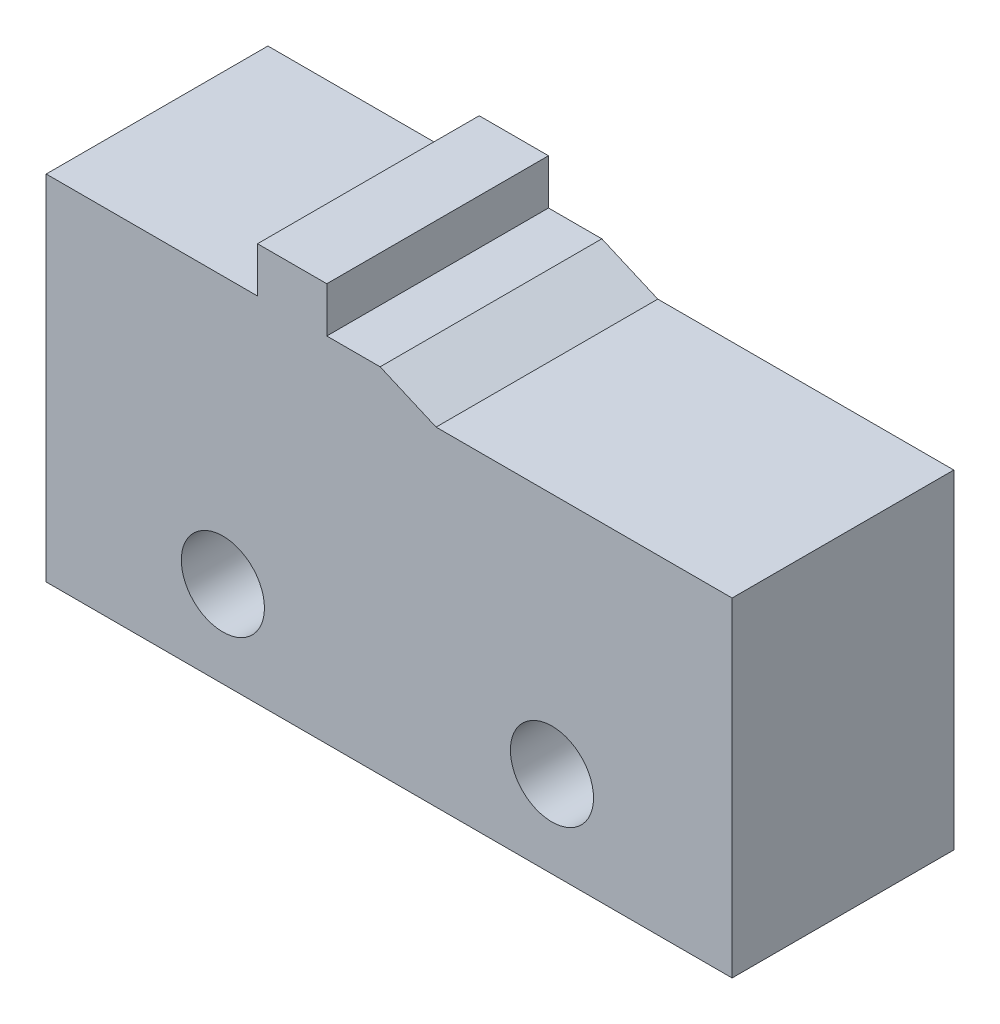
ISO-10303-21;
HEADER;
FILE_DESCRIPTION(('STEP AP214'),'2;1');
FILE_NAME('part.step','',(''),(''),'','','');
FILE_SCHEMA(('AUTOMOTIVE_DESIGN { 1 0 10303 214 1 1 1 1 }'));
ENDSEC;
DATA;
#1=APPLICATION_CONTEXT('core data for automotive mechanical design processes');
#2=APPLICATION_PROTOCOL_DEFINITION('international standard','automotive_design',2000,#1);
#3=PRODUCT_CONTEXT('',#1,'mechanical');
#4=PRODUCT('Part','Part','',(#3));
#5=PRODUCT_RELATED_PRODUCT_CATEGORY('part','',(#4));
#6=PRODUCT_DEFINITION_FORMATION('','',#4);
#7=PRODUCT_DEFINITION_CONTEXT('part definition',#1,'design');
#8=PRODUCT_DEFINITION('design','',#6,#7);
#9=PRODUCT_DEFINITION_SHAPE('','',#8);
#10=(LENGTH_UNIT() NAMED_UNIT(*) SI_UNIT(.MILLI.,.METRE.));
#11=(NAMED_UNIT(*) PLANE_ANGLE_UNIT() SI_UNIT($,.RADIAN.));
#12=(NAMED_UNIT(*) SI_UNIT($,.STERADIAN.) SOLID_ANGLE_UNIT());
#13=UNCERTAINTY_MEASURE_WITH_UNIT(LENGTH_MEASURE(1.E-05),#10,'distance_accuracy_value','');
#14=(GEOMETRIC_REPRESENTATION_CONTEXT(3) GLOBAL_UNCERTAINTY_ASSIGNED_CONTEXT((#13)) GLOBAL_UNIT_ASSIGNED_CONTEXT((#10,
#11,#12)) REPRESENTATION_CONTEXT('',''));
#15=CARTESIAN_POINT('',(0.,0.,0.));
#16=DIRECTION('',(0.,0.,1.));
#17=DIRECTION('',(1.,0.,0.));
#18=AXIS2_PLACEMENT_3D('',#15,#16,#17);
#19=CARTESIAN_POINT('',(0.,10.2,6.4));
#20=DIRECTION('',(0.,0.,-1.));
#21=DIRECTION('',(-1.,0.,0.));
#22=AXIS2_PLACEMENT_3D('',#19,#20,#21);
#23=PLANE('',#22);
#24=CARTESIAN_POINT('',(5.1,2.5,6.4));
#25=DIRECTION('',(0.,0.,1.));
#26=DIRECTION('',(1.,0.,0.));
#27=AXIS2_PLACEMENT_3D('',#24,#25,#26);
#28=CIRCLE('',#27,1.2);
#29=CARTESIAN_POINT('',(6.3,2.5,6.4));
#30=VERTEX_POINT('',#29);
#31=EDGE_CURVE('E144',#30,#30,#28,.T.);
#32=ORIENTED_EDGE('',*,*,#31,.F.);
#33=EDGE_LOOP('',(#32));
#34=FACE_BOUND('',#33,.T.);
#35=DIRECTION('',(0.,-1.,0.));
#36=VECTOR('',#35,1.);
#37=CARTESIAN_POINT('',(0.,0.,6.4));
#38=LINE('',#37,#36);
#39=CARTESIAN_POINT('',(0.,10.2,6.4));
#40=VERTEX_POINT('',#39);
#41=CARTESIAN_POINT('',(0.,0.,6.4));
#42=VERTEX_POINT('',#41);
#43=EDGE_CURVE('E159',#40,#42,#38,.T.);
#44=ORIENTED_EDGE('',*,*,#43,.T.);
#45=DIRECTION('',(1.,0.,0.));
#46=VECTOR('',#45,1.);
#47=CARTESIAN_POINT('',(0.,0.,6.4));
#48=LINE('',#47,#46);
#49=CARTESIAN_POINT('',(19.8,0.,6.4));
#50=VERTEX_POINT('',#49);
#51=EDGE_CURVE('E97',#42,#50,#48,.T.);
#52=ORIENTED_EDGE('',*,*,#51,.T.);
#53=DIRECTION('',(0.,1.,0.));
#54=VECTOR('',#53,1.);
#55=CARTESIAN_POINT('',(19.8,0.,6.4));
#56=LINE('',#55,#54);
#57=CARTESIAN_POINT('',(19.8,9.5,6.4));
#58=VERTEX_POINT('',#57);
#59=EDGE_CURVE('E180',#50,#58,#56,.T.);
#60=ORIENTED_EDGE('',*,*,#59,.T.);
#61=DIRECTION('',(-1.,0.,0.));
#62=VECTOR('',#61,1.);
#63=CARTESIAN_POINT('',(19.8,9.5,6.4));
#64=LINE('',#63,#62);
#65=CARTESIAN_POINT('',(11.254760894668,9.5,6.4));
#66=VERTEX_POINT('',#65);
#67=EDGE_CURVE('E199',#58,#66,#64,.T.);
#68=ORIENTED_EDGE('',*,*,#67,.T.);
#69=DIRECTION('',(-0.917500806613739,0.397733918421774,0.));
#70=VECTOR('',#69,1.);
#71=CARTESIAN_POINT('',(11.254760894668,9.5,6.4));
#72=LINE('',#71,#70);
#73=CARTESIAN_POINT('',(9.63998645657612,10.2,6.4));
#74=VERTEX_POINT('',#73);
#75=EDGE_CURVE('E196',#66,#74,#72,.T.);
#76=ORIENTED_EDGE('',*,*,#75,.T.);
#77=DIRECTION('',(-1.,0.,0.));
#78=VECTOR('',#77,1.);
#79=CARTESIAN_POINT('',(8.1,10.2,6.4));
#80=LINE('',#79,#78);
#81=CARTESIAN_POINT('',(8.1,10.2,6.4));
#82=VERTEX_POINT('',#81);
#83=EDGE_CURVE('E198',#74,#82,#80,.T.);
#84=ORIENTED_EDGE('',*,*,#83,.T.);
#85=DIRECTION('',(0.,1.,0.));
#86=VECTOR('',#85,1.);
#87=CARTESIAN_POINT('',(8.1,11.506737857765,6.4));
#88=LINE('',#87,#86);
#89=CARTESIAN_POINT('',(8.1,11.506737857765,6.4));
#90=VERTEX_POINT('',#89);
#91=EDGE_CURVE('E122',#82,#90,#88,.T.);
#92=ORIENTED_EDGE('',*,*,#91,.T.);
#93=DIRECTION('',(-1.,0.,0.));
#94=VECTOR('',#93,1.);
#95=CARTESIAN_POINT('',(6.1,11.506737857765,6.4));
#96=LINE('',#95,#94);
#97=CARTESIAN_POINT('',(6.1,11.506737857765,6.4));
#98=VERTEX_POINT('',#97);
#99=EDGE_CURVE('E116',#90,#98,#96,.T.);
#100=ORIENTED_EDGE('',*,*,#99,.T.);
#101=DIRECTION('',(0.,-1.,0.));
#102=VECTOR('',#101,1.);
#103=CARTESIAN_POINT('',(6.1,10.2,6.4));
#104=LINE('',#103,#102);
#105=CARTESIAN_POINT('',(6.1,10.2,6.4));
#106=VERTEX_POINT('',#105);
#107=EDGE_CURVE('E120',#98,#106,#104,.T.);
#108=ORIENTED_EDGE('',*,*,#107,.T.);
#109=DIRECTION('',(-1.,0.,0.));
#110=VECTOR('',#109,1.);
#111=CARTESIAN_POINT('',(0.,10.2,6.4));
#112=LINE('',#111,#110);
#113=EDGE_CURVE('E48',#106,#40,#112,.T.);
#114=ORIENTED_EDGE('',*,*,#113,.T.);
#115=EDGE_LOOP('',(#44,#52,#60,#68,#76,#84,#92,#100,#108,#114));
#116=FACE_BOUND('',#115,.T.);
#117=CARTESIAN_POINT('',(14.6,2.5,6.4));
#118=DIRECTION('',(0.,0.,1.));
#119=DIRECTION('',(1.,0.,0.));
#120=AXIS2_PLACEMENT_3D('',#117,#118,#119);
#121=CIRCLE('',#120,1.2);
#122=CARTESIAN_POINT('',(15.8,2.5,6.4));
#123=VERTEX_POINT('',#122);
#124=EDGE_CURVE('E210',#123,#123,#121,.T.);
#125=ORIENTED_EDGE('',*,*,#124,.F.);
#126=EDGE_LOOP('',(#125));
#127=FACE_BOUND('',#126,.T.);
#128=ADVANCED_FACE('F31',(#34,#116,#127),#23,.F.);
#129=CARTESIAN_POINT('',(0.,10.2,0.));
#130=DIRECTION('',(0.,0.,-1.));
#131=DIRECTION('',(-1.,0.,0.));
#132=AXIS2_PLACEMENT_3D('',#129,#130,#131);
#133=PLANE('',#132);
#134=CARTESIAN_POINT('',(5.1,2.5,0.));
#135=DIRECTION('',(0.,0.,1.));
#136=DIRECTION('',(1.,0.,0.));
#137=AXIS2_PLACEMENT_3D('',#134,#135,#136);
#138=CIRCLE('',#137,1.2);
#139=CARTESIAN_POINT('',(6.3,2.5,0.));
#140=VERTEX_POINT('',#139);
#141=EDGE_CURVE('E207',#140,#140,#138,.T.);
#142=ORIENTED_EDGE('',*,*,#141,.T.);
#143=EDGE_LOOP('',(#142));
#144=FACE_BOUND('',#143,.T.);
#145=DIRECTION('',(0.,-1.,0.));
#146=VECTOR('',#145,1.);
#147=CARTESIAN_POINT('',(0.,0.,0.));
#148=LINE('',#147,#146);
#149=CARTESIAN_POINT('',(0.,10.2,0.));
#150=VERTEX_POINT('',#149);
#151=CARTESIAN_POINT('',(0.,0.,0.));
#152=VERTEX_POINT('',#151);
#153=EDGE_CURVE('E140',#150,#152,#148,.T.);
#154=ORIENTED_EDGE('',*,*,#153,.F.);
#155=DIRECTION('',(-1.,0.,0.));
#156=VECTOR('',#155,1.);
#157=CARTESIAN_POINT('',(0.,10.2,0.));
#158=LINE('',#157,#156);
#159=CARTESIAN_POINT('',(6.1,10.2,0.));
#160=VERTEX_POINT('',#159);
#161=EDGE_CURVE('E89',#160,#150,#158,.T.);
#162=ORIENTED_EDGE('',*,*,#161,.F.);
#163=DIRECTION('',(0.,-1.,0.));
#164=VECTOR('',#163,1.);
#165=CARTESIAN_POINT('',(6.1,10.2,0.));
#166=LINE('',#165,#164);
#167=CARTESIAN_POINT('',(6.1,11.506737857765,0.));
#168=VERTEX_POINT('',#167);
#169=EDGE_CURVE('E83',#168,#160,#166,.T.);
#170=ORIENTED_EDGE('',*,*,#169,.F.);
#171=DIRECTION('',(-1.,0.,0.));
#172=VECTOR('',#171,1.);
#173=CARTESIAN_POINT('',(6.1,11.506737857765,0.));
#174=LINE('',#173,#172);
#175=CARTESIAN_POINT('',(8.1,11.506737857765,0.));
#176=VERTEX_POINT('',#175);
#177=EDGE_CURVE('E130',#176,#168,#174,.T.);
#178=ORIENTED_EDGE('',*,*,#177,.F.);
#179=DIRECTION('',(0.,1.,0.));
#180=VECTOR('',#179,1.);
#181=CARTESIAN_POINT('',(8.1,11.506737857765,0.));
#182=LINE('',#181,#180);
#183=CARTESIAN_POINT('',(8.1,10.2,0.));
#184=VERTEX_POINT('',#183);
#185=EDGE_CURVE('E154',#184,#176,#182,.T.);
#186=ORIENTED_EDGE('',*,*,#185,.F.);
#187=DIRECTION('',(-1.,0.,0.));
#188=VECTOR('',#187,1.);
#189=CARTESIAN_POINT('',(8.1,10.2,0.));
#190=LINE('',#189,#188);
#191=CARTESIAN_POINT('',(9.63998645657612,10.2,0.));
#192=VERTEX_POINT('',#191);
#193=EDGE_CURVE('E152',#192,#184,#190,.T.);
#194=ORIENTED_EDGE('',*,*,#193,.F.);
#195=DIRECTION('',(-0.917500806613739,0.397733918421774,0.));
#196=VECTOR('',#195,1.);
#197=CARTESIAN_POINT('',(11.254760894668,9.5,0.));
#198=LINE('',#197,#196);
#199=CARTESIAN_POINT('',(11.254760894668,9.5,0.));
#200=VERTEX_POINT('',#199);
#201=EDGE_CURVE('E150',#200,#192,#198,.T.);
#202=ORIENTED_EDGE('',*,*,#201,.F.);
#203=DIRECTION('',(-1.,0.,0.));
#204=VECTOR('',#203,1.);
#205=CARTESIAN_POINT('',(19.8,9.5,0.));
#206=LINE('',#205,#204);
#207=CARTESIAN_POINT('',(19.8,9.5,0.));
#208=VERTEX_POINT('',#207);
#209=EDGE_CURVE('E148',#208,#200,#206,.T.);
#210=ORIENTED_EDGE('',*,*,#209,.F.);
#211=DIRECTION('',(0.,1.,0.));
#212=VECTOR('',#211,1.);
#213=CARTESIAN_POINT('',(19.8,0.,0.));
#214=LINE('',#213,#212);
#215=CARTESIAN_POINT('',(19.8,0.,0.));
#216=VERTEX_POINT('',#215);
#217=EDGE_CURVE('E146',#216,#208,#214,.T.);
#218=ORIENTED_EDGE('',*,*,#217,.F.);
#219=DIRECTION('',(1.,0.,0.));
#220=VECTOR('',#219,1.);
#221=CARTESIAN_POINT('',(0.,0.,0.));
#222=LINE('',#221,#220);
#223=EDGE_CURVE('E143',#152,#216,#222,.T.);
#224=ORIENTED_EDGE('',*,*,#223,.F.);
#225=EDGE_LOOP('',(#154,#162,#170,#178,#186,#194,#202,#210,#218,#224));
#226=FACE_BOUND('',#225,.T.);
#227=CARTESIAN_POINT('',(14.6,2.5,0.));
#228=DIRECTION('',(0.,0.,1.));
#229=DIRECTION('',(1.,0.,0.));
#230=AXIS2_PLACEMENT_3D('',#227,#228,#229);
#231=CIRCLE('',#230,1.2);
#232=CARTESIAN_POINT('',(15.8,2.5,0.));
#233=VERTEX_POINT('',#232);
#234=EDGE_CURVE('E213',#233,#233,#231,.T.);
#235=ORIENTED_EDGE('',*,*,#234,.T.);
#236=EDGE_LOOP('',(#235));
#237=FACE_BOUND('',#236,.T.);
#238=ADVANCED_FACE('F184',(#144,#226,#237),#133,.T.);
#239=CARTESIAN_POINT('',(0.,0.,6.4));
#240=DIRECTION('',(1.,0.,0.));
#241=DIRECTION('',(0.,0.,-1.));
#242=AXIS2_PLACEMENT_3D('',#239,#240,#241);
#243=PLANE('',#242);
#244=ORIENTED_EDGE('',*,*,#153,.T.);
#245=DIRECTION('',(0.,0.,-1.));
#246=VECTOR('',#245,1.);
#247=CARTESIAN_POINT('',(0.,0.,6.4));
#248=LINE('',#247,#246);
#249=EDGE_CURVE('E11',#42,#152,#248,.T.);
#250=ORIENTED_EDGE('',*,*,#249,.F.);
#251=ORIENTED_EDGE('',*,*,#43,.F.);
#252=DIRECTION('',(0.,0.,-1.));
#253=VECTOR('',#252,1.);
#254=CARTESIAN_POINT('',(0.,10.2,6.4));
#255=LINE('',#254,#253);
#256=EDGE_CURVE('E136',#40,#150,#255,.T.);
#257=ORIENTED_EDGE('',*,*,#256,.T.);
#258=EDGE_LOOP('',(#244,#250,#251,#257));
#259=FACE_BOUND('',#258,.T.);
#260=ADVANCED_FACE('F33',(#259),#243,.F.);
#261=CARTESIAN_POINT('',(0.,0.,6.4));
#262=DIRECTION('',(0.,1.,0.));
#263=DIRECTION('',(0.,0.,1.));
#264=AXIS2_PLACEMENT_3D('',#261,#262,#263);
#265=PLANE('',#264);
#266=ORIENTED_EDGE('',*,*,#223,.T.);
#267=DIRECTION('',(0.,0.,-1.));
#268=VECTOR('',#267,1.);
#269=CARTESIAN_POINT('',(19.8,0.,6.4));
#270=LINE('',#269,#268);
#271=EDGE_CURVE('E40',#50,#216,#270,.T.);
#272=ORIENTED_EDGE('',*,*,#271,.F.);
#273=ORIENTED_EDGE('',*,*,#51,.F.);
#274=ORIENTED_EDGE('',*,*,#249,.T.);
#275=EDGE_LOOP('',(#266,#272,#273,#274));
#276=FACE_BOUND('',#275,.T.);
#277=ADVANCED_FACE('F254',(#276),#265,.F.);
#278=CARTESIAN_POINT('',(19.8,0.,6.4));
#279=DIRECTION('',(-1.,0.,0.));
#280=DIRECTION('',(0.,0.,1.));
#281=AXIS2_PLACEMENT_3D('',#278,#279,#280);
#282=PLANE('',#281);
#283=ORIENTED_EDGE('',*,*,#217,.T.);
#284=DIRECTION('',(0.,0.,-1.));
#285=VECTOR('',#284,1.);
#286=CARTESIAN_POINT('',(19.8,9.5,6.4));
#287=LINE('',#286,#285);
#288=EDGE_CURVE('E172',#58,#208,#287,.T.);
#289=ORIENTED_EDGE('',*,*,#288,.F.);
#290=ORIENTED_EDGE('',*,*,#59,.F.);
#291=ORIENTED_EDGE('',*,*,#271,.T.);
#292=EDGE_LOOP('',(#283,#289,#290,#291));
#293=FACE_BOUND('',#292,.T.);
#294=ADVANCED_FACE('F178',(#293),#282,.F.);
#295=CARTESIAN_POINT('',(19.8,9.5,6.4));
#296=DIRECTION('',(0.,-1.,0.));
#297=DIRECTION('',(1.,0.,0.));
#298=AXIS2_PLACEMENT_3D('',#295,#296,#297);
#299=PLANE('',#298);
#300=ORIENTED_EDGE('',*,*,#209,.T.);
#301=DIRECTION('',(0.,0.,-1.));
#302=VECTOR('',#301,1.);
#303=CARTESIAN_POINT('',(11.254760894668,9.5,6.4));
#304=LINE('',#303,#302);
#305=EDGE_CURVE('E169',#66,#200,#304,.T.);
#306=ORIENTED_EDGE('',*,*,#305,.F.);
#307=ORIENTED_EDGE('',*,*,#67,.F.);
#308=ORIENTED_EDGE('',*,*,#288,.T.);
#309=EDGE_LOOP('',(#300,#306,#307,#308));
#310=FACE_BOUND('',#309,.T.);
#311=ADVANCED_FACE('F190',(#310),#299,.F.);
#312=CARTESIAN_POINT('',(11.254760894668,9.5,6.4));
#313=DIRECTION('',(-0.397733918421774,-0.917500806613739,0.));
#314=DIRECTION('',(0.917500806613739,-0.397733918421774,0.));
#315=AXIS2_PLACEMENT_3D('',#312,#313,#314);
#316=PLANE('',#315);
#317=ORIENTED_EDGE('',*,*,#201,.T.);
#318=DIRECTION('',(0.,0.,-1.));
#319=VECTOR('',#318,1.);
#320=CARTESIAN_POINT('',(9.63998645657612,10.2,6.4));
#321=LINE('',#320,#319);
#322=EDGE_CURVE('E166',#74,#192,#321,.T.);
#323=ORIENTED_EDGE('',*,*,#322,.F.);
#324=ORIENTED_EDGE('',*,*,#75,.F.);
#325=ORIENTED_EDGE('',*,*,#305,.T.);
#326=EDGE_LOOP('',(#317,#323,#324,#325));
#327=FACE_BOUND('',#326,.T.);
#328=ADVANCED_FACE('F194',(#327),#316,.F.);
#329=CARTESIAN_POINT('',(8.1,10.2,6.4));
#330=DIRECTION('',(0.,-1.,0.));
#331=DIRECTION('',(0.,0.,-1.));
#332=AXIS2_PLACEMENT_3D('',#329,#330,#331);
#333=PLANE('',#332);
#334=ORIENTED_EDGE('',*,*,#193,.T.);
#335=DIRECTION('',(0.,0.,-1.));
#336=VECTOR('',#335,1.);
#337=CARTESIAN_POINT('',(8.1,10.2,6.4));
#338=LINE('',#337,#336);
#339=EDGE_CURVE('E163',#82,#184,#338,.T.);
#340=ORIENTED_EDGE('',*,*,#339,.F.);
#341=ORIENTED_EDGE('',*,*,#83,.F.);
#342=ORIENTED_EDGE('',*,*,#322,.T.);
#343=EDGE_LOOP('',(#334,#340,#341,#342));
#344=FACE_BOUND('',#343,.T.);
#345=ADVANCED_FACE('F244',(#344),#333,.F.);
#346=CARTESIAN_POINT('',(8.1,11.506737857765,6.4));
#347=DIRECTION('',(-1.,0.,0.));
#348=DIRECTION('',(0.,0.,1.));
#349=AXIS2_PLACEMENT_3D('',#346,#347,#348);
#350=PLANE('',#349);
#351=ORIENTED_EDGE('',*,*,#185,.T.);
#352=DIRECTION('',(0.,0.,-1.));
#353=VECTOR('',#352,1.);
#354=CARTESIAN_POINT('',(8.1,11.506737857765,6.4));
#355=LINE('',#354,#353);
#356=EDGE_CURVE('E131',#90,#176,#355,.T.);
#357=ORIENTED_EDGE('',*,*,#356,.F.);
#358=ORIENTED_EDGE('',*,*,#91,.F.);
#359=ORIENTED_EDGE('',*,*,#339,.T.);
#360=EDGE_LOOP('',(#351,#357,#358,#359));
#361=FACE_BOUND('',#360,.T.);
#362=ADVANCED_FACE('F241',(#361),#350,.F.);
#363=CARTESIAN_POINT('',(6.1,11.506737857765,6.4));
#364=DIRECTION('',(0.,-1.,0.));
#365=DIRECTION('',(0.,0.,-1.));
#366=AXIS2_PLACEMENT_3D('',#363,#364,#365);
#367=PLANE('',#366);
#368=ORIENTED_EDGE('',*,*,#177,.T.);
#369=DIRECTION('',(0.,0.,-1.));
#370=VECTOR('',#369,1.);
#371=CARTESIAN_POINT('',(6.1,11.506737857765,6.4));
#372=LINE('',#371,#370);
#373=EDGE_CURVE('E127',#98,#168,#372,.T.);
#374=ORIENTED_EDGE('',*,*,#373,.F.);
#375=ORIENTED_EDGE('',*,*,#99,.F.);
#376=ORIENTED_EDGE('',*,*,#356,.T.);
#377=EDGE_LOOP('',(#368,#374,#375,#376));
#378=FACE_BOUND('',#377,.T.);
#379=ADVANCED_FACE('F128',(#378),#367,.F.);
#380=CARTESIAN_POINT('',(6.1,10.2,6.4));
#381=DIRECTION('',(1.,0.,0.));
#382=DIRECTION('',(0.,0.,-1.));
#383=AXIS2_PLACEMENT_3D('',#380,#381,#382);
#384=PLANE('',#383);
#385=ORIENTED_EDGE('',*,*,#169,.T.);
#386=DIRECTION('',(0.,0.,-1.));
#387=VECTOR('',#386,1.);
#388=CARTESIAN_POINT('',(6.1,10.2,6.4));
#389=LINE('',#388,#387);
#390=EDGE_CURVE('E132',#106,#160,#389,.T.);
#391=ORIENTED_EDGE('',*,*,#390,.F.);
#392=ORIENTED_EDGE('',*,*,#107,.F.);
#393=ORIENTED_EDGE('',*,*,#373,.T.);
#394=EDGE_LOOP('',(#385,#391,#392,#393));
#395=FACE_BOUND('',#394,.T.);
#396=ADVANCED_FACE('F134',(#395),#384,.F.);
#397=CARTESIAN_POINT('',(0.,10.2,6.4));
#398=DIRECTION('',(0.,-1.,0.));
#399=DIRECTION('',(0.,0.,-1.));
#400=AXIS2_PLACEMENT_3D('',#397,#398,#399);
#401=PLANE('',#400);
#402=ORIENTED_EDGE('',*,*,#161,.T.);
#403=ORIENTED_EDGE('',*,*,#256,.F.);
#404=ORIENTED_EDGE('',*,*,#113,.F.);
#405=ORIENTED_EDGE('',*,*,#390,.T.);
#406=EDGE_LOOP('',(#402,#403,#404,#405));
#407=FACE_BOUND('',#406,.T.);
#408=ADVANCED_FACE('F234',(#407),#401,.F.);
#409=CARTESIAN_POINT('',(5.1,2.5,6.4));
#410=DIRECTION('',(0.,0.,-1.));
#411=DIRECTION('',(-1.,0.,0.));
#412=AXIS2_PLACEMENT_3D('',#409,#410,#411);
#413=CYLINDRICAL_SURFACE('',#412,1.2);
#414=ORIENTED_EDGE('',*,*,#31,.T.);
#415=EDGE_LOOP('',(#414));
#416=FACE_BOUND('',#415,.T.);
#417=ORIENTED_EDGE('',*,*,#141,.F.);
#418=EDGE_LOOP('',(#417));
#419=FACE_BOUND('',#418,.T.);
#420=ADVANCED_FACE('F231',(#416,#419),#413,.F.);
#421=CARTESIAN_POINT('',(14.6,2.5,6.4));
#422=DIRECTION('',(0.,0.,-1.));
#423=DIRECTION('',(-1.,0.,0.));
#424=AXIS2_PLACEMENT_3D('',#421,#422,#423);
#425=CYLINDRICAL_SURFACE('',#424,1.2);
#426=ORIENTED_EDGE('',*,*,#124,.T.);
#427=EDGE_LOOP('',(#426));
#428=FACE_BOUND('',#427,.T.);
#429=ORIENTED_EDGE('',*,*,#234,.F.);
#430=EDGE_LOOP('',(#429));
#431=FACE_BOUND('',#430,.T.);
#432=ADVANCED_FACE('F219',(#428,#431),#425,.F.);
#433=CLOSED_SHELL('',(#128,#238,#260,#277,#294,#311,#328,#345,#362,#379,#396,#408,#420,#432));
#434=MANIFOLD_SOLID_BREP('B2',#433);
#435=ADVANCED_BREP_SHAPE_REPRESENTATION('',(#18,#434),#14);
#436=SHAPE_DEFINITION_REPRESENTATION(#9,#435);
ENDSEC;
END-ISO-10303-21;
